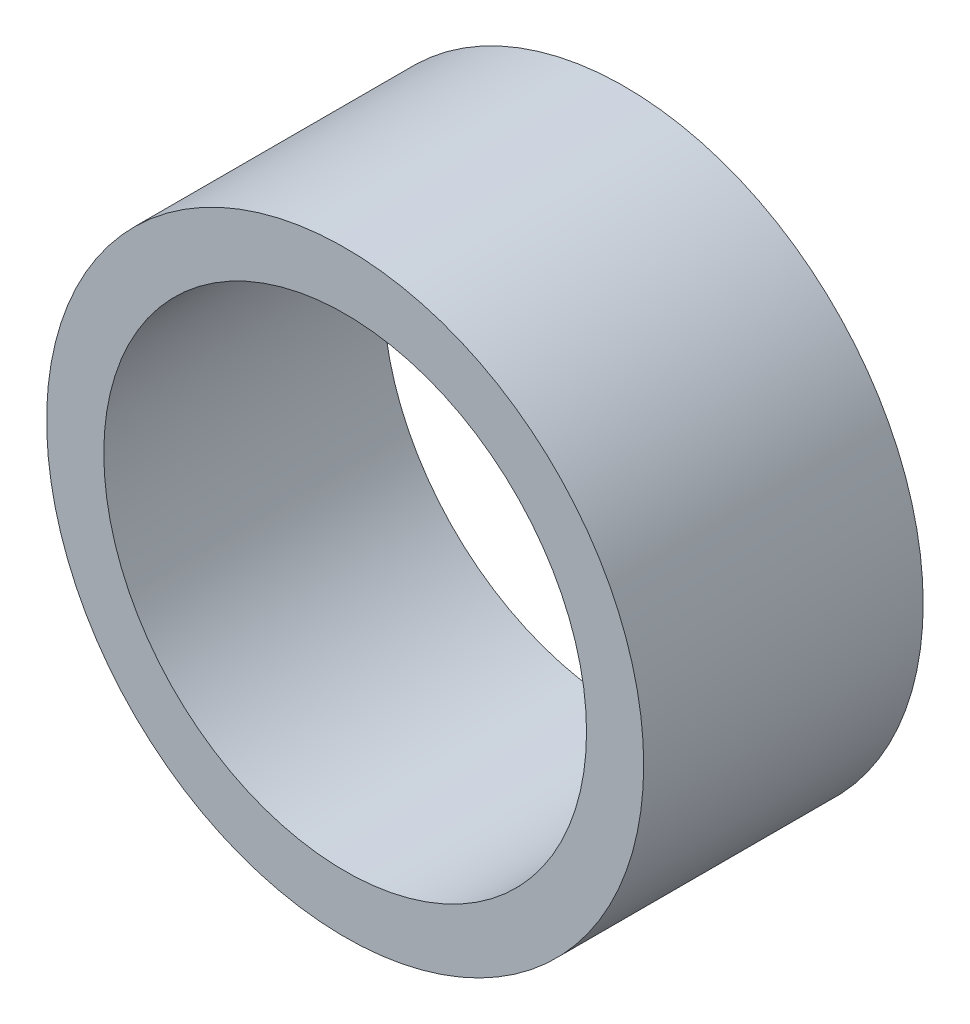
ISO-10303-21;
HEADER;
FILE_DESCRIPTION(('STEP AP214'),'2;1');
FILE_NAME('part.step','',(''),(''),'','','');
FILE_SCHEMA(('AUTOMOTIVE_DESIGN { 1 0 10303 214 1 1 1 1 }'));
ENDSEC;
DATA;
#1=APPLICATION_CONTEXT('core data for automotive mechanical design processes');
#2=APPLICATION_PROTOCOL_DEFINITION('international standard','automotive_design',2000,#1);
#3=PRODUCT_CONTEXT('',#1,'mechanical');
#4=PRODUCT('Part','Part','',(#3));
#5=PRODUCT_RELATED_PRODUCT_CATEGORY('part','',(#4));
#6=PRODUCT_DEFINITION_FORMATION('','',#4);
#7=PRODUCT_DEFINITION_CONTEXT('part definition',#1,'design');
#8=PRODUCT_DEFINITION('design','',#6,#7);
#9=PRODUCT_DEFINITION_SHAPE('','',#8);
#10=(LENGTH_UNIT() NAMED_UNIT(*) SI_UNIT(.MILLI.,.METRE.));
#11=(NAMED_UNIT(*) PLANE_ANGLE_UNIT() SI_UNIT($,.RADIAN.));
#12=(NAMED_UNIT(*) SI_UNIT($,.STERADIAN.) SOLID_ANGLE_UNIT());
#13=UNCERTAINTY_MEASURE_WITH_UNIT(LENGTH_MEASURE(1.E-05),#10,'distance_accuracy_value','');
#14=(GEOMETRIC_REPRESENTATION_CONTEXT(3) GLOBAL_UNCERTAINTY_ASSIGNED_CONTEXT((#13)) GLOBAL_UNIT_ASSIGNED_CONTEXT((#10,
#11,#12)) REPRESENTATION_CONTEXT('',''));
#15=CARTESIAN_POINT('',(0.,0.,0.));
#16=DIRECTION('',(0.,0.,1.));
#17=DIRECTION('',(1.,0.,0.));
#18=AXIS2_PLACEMENT_3D('',#15,#16,#17);
#19=CARTESIAN_POINT('',(0.,0.,22.));
#20=DIRECTION('',(0.,0.,1.));
#21=DIRECTION('',(1.,0.,0.));
#22=AXIS2_PLACEMENT_3D('',#19,#20,#21);
#23=PLANE('',#22);
#24=CARTESIAN_POINT('',(0.,0.,22.));
#25=DIRECTION('',(0.,0.,1.));
#26=DIRECTION('',(1.,0.,0.));
#27=AXIS2_PLACEMENT_3D('',#24,#25,#26);
#28=CIRCLE('',#27,23.5);
#29=CARTESIAN_POINT('',(23.5,0.,22.));
#30=VERTEX_POINT('',#29);
#31=EDGE_CURVE('E10',#30,#30,#28,.T.);
#32=ORIENTED_EDGE('',*,*,#31,.T.);
#33=EDGE_LOOP('',(#32));
#34=FACE_BOUND('',#33,.T.);
#35=CARTESIAN_POINT('',(0.,0.,22.));
#36=DIRECTION('',(0.,0.,1.));
#37=DIRECTION('',(1.,0.,0.));
#38=AXIS2_PLACEMENT_3D('',#35,#36,#37);
#39=CIRCLE('',#38,19.);
#40=CARTESIAN_POINT('',(19.,0.,22.));
#41=VERTEX_POINT('',#40);
#42=EDGE_CURVE('E54',#41,#41,#39,.T.);
#43=ORIENTED_EDGE('',*,*,#42,.F.);
#44=EDGE_LOOP('',(#43));
#45=FACE_BOUND('',#44,.T.);
#46=ADVANCED_FACE('F41',(#34,#45),#23,.T.);
#47=CARTESIAN_POINT('',(0.,0.,0.));
#48=DIRECTION('',(0.,0.,1.));
#49=DIRECTION('',(1.,0.,0.));
#50=AXIS2_PLACEMENT_3D('',#47,#48,#49);
#51=PLANE('',#50);
#52=CARTESIAN_POINT('',(0.,0.,0.));
#53=DIRECTION('',(0.,0.,1.));
#54=DIRECTION('',(1.,0.,0.));
#55=AXIS2_PLACEMENT_3D('',#52,#53,#54);
#56=CIRCLE('',#55,23.5);
#57=CARTESIAN_POINT('',(23.5,0.,0.));
#58=VERTEX_POINT('',#57);
#59=EDGE_CURVE('E45',#58,#58,#56,.T.);
#60=ORIENTED_EDGE('',*,*,#59,.F.);
#61=EDGE_LOOP('',(#60));
#62=FACE_BOUND('',#61,.T.);
#63=CARTESIAN_POINT('',(0.,0.,0.));
#64=DIRECTION('',(0.,0.,1.));
#65=DIRECTION('',(1.,0.,0.));
#66=AXIS2_PLACEMENT_3D('',#63,#64,#65);
#67=CIRCLE('',#66,19.);
#68=CARTESIAN_POINT('',(19.,0.,0.));
#69=VERTEX_POINT('',#68);
#70=EDGE_CURVE('E56',#69,#69,#67,.T.);
#71=ORIENTED_EDGE('',*,*,#70,.T.);
#72=EDGE_LOOP('',(#71));
#73=FACE_BOUND('',#72,.T.);
#74=ADVANCED_FACE('F68',(#62,#73),#51,.F.);
#75=CARTESIAN_POINT('',(0.,0.,22.));
#76=DIRECTION('',(0.,0.,-1.));
#77=DIRECTION('',(-1.,0.,0.));
#78=AXIS2_PLACEMENT_3D('',#75,#76,#77);
#79=CYLINDRICAL_SURFACE('',#78,23.5);
#80=ORIENTED_EDGE('',*,*,#31,.F.);
#81=EDGE_LOOP('',(#80));
#82=FACE_BOUND('',#81,.T.);
#83=ORIENTED_EDGE('',*,*,#59,.T.);
#84=EDGE_LOOP('',(#83));
#85=FACE_BOUND('',#84,.T.);
#86=ADVANCED_FACE('F43',(#82,#85),#79,.T.);
#87=CARTESIAN_POINT('',(0.,0.,22.));
#88=DIRECTION('',(0.,0.,-1.));
#89=DIRECTION('',(-1.,0.,0.));
#90=AXIS2_PLACEMENT_3D('',#87,#88,#89);
#91=CYLINDRICAL_SURFACE('',#90,19.);
#92=ORIENTED_EDGE('',*,*,#42,.T.);
#93=EDGE_LOOP('',(#92));
#94=FACE_BOUND('',#93,.T.);
#95=ORIENTED_EDGE('',*,*,#70,.F.);
#96=EDGE_LOOP('',(#95));
#97=FACE_BOUND('',#96,.T.);
#98=ADVANCED_FACE('F64',(#94,#97),#91,.F.);
#99=CLOSED_SHELL('',(#46,#74,#86,#98));
#100=MANIFOLD_SOLID_BREP('B2',#99);
#101=ADVANCED_BREP_SHAPE_REPRESENTATION('',(#18,#100),#14);
#102=SHAPE_DEFINITION_REPRESENTATION(#9,#101);
ENDSEC;
END-ISO-10303-21;
